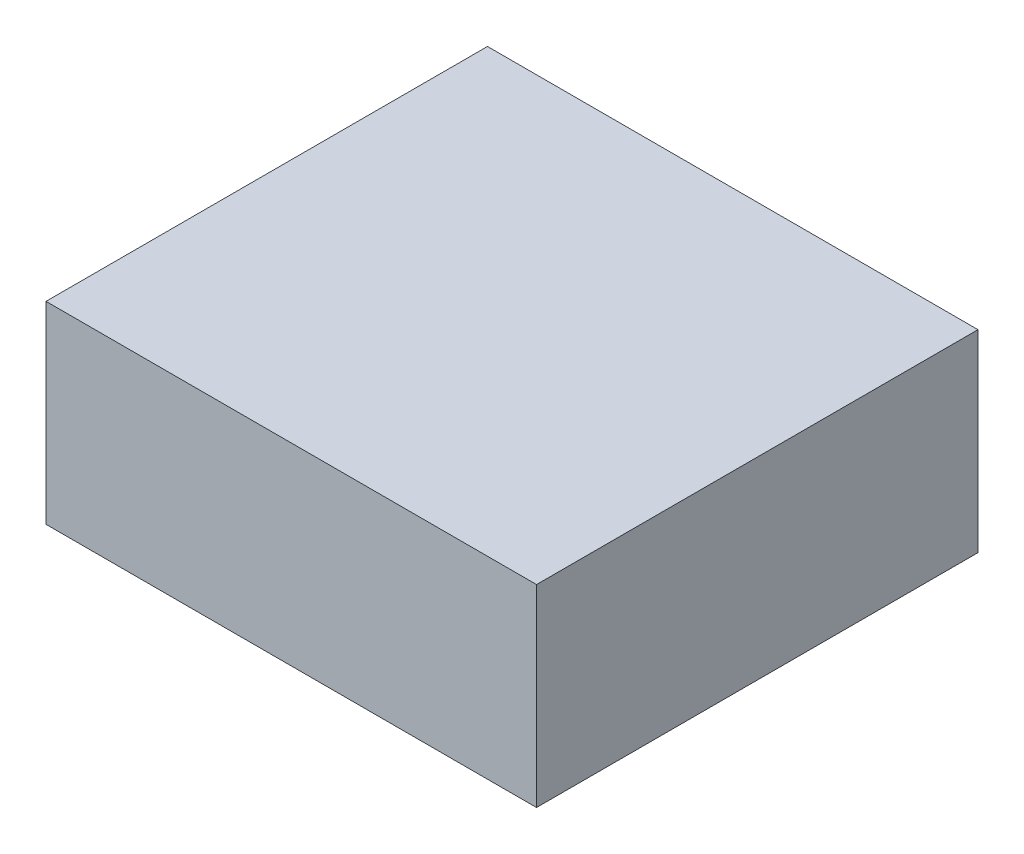
ISO-10303-21;
HEADER;
FILE_DESCRIPTION(('STEP AP214'),'2;1');
FILE_NAME('part.step','',(''),(''),'','','');
FILE_SCHEMA(('AUTOMOTIVE_DESIGN { 1 0 10303 214 1 1 1 1 }'));
ENDSEC;
DATA;
#1=APPLICATION_CONTEXT('core data for automotive mechanical design processes');
#2=APPLICATION_PROTOCOL_DEFINITION('international standard','automotive_design',2000,#1);
#3=PRODUCT_CONTEXT('',#1,'mechanical');
#4=PRODUCT('Part','Part','',(#3));
#5=PRODUCT_RELATED_PRODUCT_CATEGORY('part','',(#4));
#6=PRODUCT_DEFINITION_FORMATION('','',#4);
#7=PRODUCT_DEFINITION_CONTEXT('part definition',#1,'design');
#8=PRODUCT_DEFINITION('design','',#6,#7);
#9=PRODUCT_DEFINITION_SHAPE('','',#8);
#10=(LENGTH_UNIT() NAMED_UNIT(*) SI_UNIT(.MILLI.,.METRE.));
#11=(NAMED_UNIT(*) PLANE_ANGLE_UNIT() SI_UNIT($,.RADIAN.));
#12=(NAMED_UNIT(*) SI_UNIT($,.STERADIAN.) SOLID_ANGLE_UNIT());
#13=UNCERTAINTY_MEASURE_WITH_UNIT(LENGTH_MEASURE(1.E-05),#10,'distance_accuracy_value','');
#14=(GEOMETRIC_REPRESENTATION_CONTEXT(3) GLOBAL_UNCERTAINTY_ASSIGNED_CONTEXT((#13)) GLOBAL_UNIT_ASSIGNED_CONTEXT((#10,
#11,#12)) REPRESENTATION_CONTEXT('',''));
#15=CARTESIAN_POINT('',(0.,0.,0.));
#16=DIRECTION('',(0.,0.,1.));
#17=DIRECTION('',(1.,0.,0.));
#18=AXIS2_PLACEMENT_3D('',#15,#16,#17);
#19=CARTESIAN_POINT('',(12.7,10.,11.43));
#20=DIRECTION('',(-1.,0.,0.));
#21=DIRECTION('',(0.,0.,1.));
#22=AXIS2_PLACEMENT_3D('',#19,#20,#21);
#23=PLANE('',#22);
#24=DIRECTION('',(0.,0.,-1.));
#25=VECTOR('',#24,1.);
#26=CARTESIAN_POINT('',(12.7,0.,11.43));
#27=LINE('',#26,#25);
#28=CARTESIAN_POINT('',(12.7,0.,11.43));
#29=VERTEX_POINT('',#28);
#30=CARTESIAN_POINT('',(12.7,0.,-11.43));
#31=VERTEX_POINT('',#30);
#32=EDGE_CURVE('E96',#29,#31,#27,.T.);
#33=ORIENTED_EDGE('',*,*,#32,.T.);
#34=DIRECTION('',(0.,-1.,0.));
#35=VECTOR('',#34,1.);
#36=CARTESIAN_POINT('',(12.7,10.,-11.43));
#37=LINE('',#36,#35);
#38=CARTESIAN_POINT('',(12.7,10.,-11.43));
#39=VERTEX_POINT('',#38);
#40=EDGE_CURVE('E11',#39,#31,#37,.T.);
#41=ORIENTED_EDGE('',*,*,#40,.F.);
#42=DIRECTION('',(0.,0.,-1.));
#43=VECTOR('',#42,1.);
#44=CARTESIAN_POINT('',(12.7,10.,11.43));
#45=LINE('',#44,#43);
#46=CARTESIAN_POINT('',(12.7,10.,11.43));
#47=VERTEX_POINT('',#46);
#48=EDGE_CURVE('E84',#47,#39,#45,.T.);
#49=ORIENTED_EDGE('',*,*,#48,.F.);
#50=DIRECTION('',(0.,-1.,0.));
#51=VECTOR('',#50,1.);
#52=CARTESIAN_POINT('',(12.7,10.,11.43));
#53=LINE('',#52,#51);
#54=EDGE_CURVE('E92',#47,#29,#53,.T.);
#55=ORIENTED_EDGE('',*,*,#54,.T.);
#56=EDGE_LOOP('',(#33,#41,#49,#55));
#57=FACE_BOUND('',#56,.T.);
#58=ADVANCED_FACE('F33',(#57),#23,.F.);
#59=CARTESIAN_POINT('',(-12.7,10.,-11.43));
#60=DIRECTION('',(0.,0.,1.));
#61=DIRECTION('',(1.,0.,0.));
#62=AXIS2_PLACEMENT_3D('',#59,#60,#61);
#63=PLANE('',#62);
#64=DIRECTION('',(-1.,0.,0.));
#65=VECTOR('',#64,1.);
#66=CARTESIAN_POINT('',(-12.7,0.,-11.43));
#67=LINE('',#66,#65);
#68=CARTESIAN_POINT('',(-12.7,0.,-11.43));
#69=VERTEX_POINT('',#68);
#70=EDGE_CURVE('E88',#31,#69,#67,.T.);
#71=ORIENTED_EDGE('',*,*,#70,.T.);
#72=DIRECTION('',(0.,-1.,0.));
#73=VECTOR('',#72,1.);
#74=CARTESIAN_POINT('',(-12.7,10.,-11.43));
#75=LINE('',#74,#73);
#76=CARTESIAN_POINT('',(-12.7,10.,-11.43));
#77=VERTEX_POINT('',#76);
#78=EDGE_CURVE('E41',#77,#69,#75,.T.);
#79=ORIENTED_EDGE('',*,*,#78,.F.);
#80=DIRECTION('',(-1.,0.,0.));
#81=VECTOR('',#80,1.);
#82=CARTESIAN_POINT('',(-12.7,10.,-11.43));
#83=LINE('',#82,#81);
#84=EDGE_CURVE('E79',#39,#77,#83,.T.);
#85=ORIENTED_EDGE('',*,*,#84,.F.);
#86=ORIENTED_EDGE('',*,*,#40,.T.);
#87=EDGE_LOOP('',(#71,#79,#85,#86));
#88=FACE_BOUND('',#87,.T.);
#89=ADVANCED_FACE('F87',(#88),#63,.F.);
#90=CARTESIAN_POINT('',(-12.7,10.,11.43));
#91=DIRECTION('',(1.,0.,0.));
#92=DIRECTION('',(0.,0.,-1.));
#93=AXIS2_PLACEMENT_3D('',#90,#91,#92);
#94=PLANE('',#93);
#95=DIRECTION('',(0.,0.,1.));
#96=VECTOR('',#95,1.);
#97=CARTESIAN_POINT('',(-12.7,0.,11.43));
#98=LINE('',#97,#96);
#99=CARTESIAN_POINT('',(-12.7,0.,11.43));
#100=VERTEX_POINT('',#99);
#101=EDGE_CURVE('E66',#69,#100,#98,.T.);
#102=ORIENTED_EDGE('',*,*,#101,.T.);
#103=DIRECTION('',(0.,-1.,0.));
#104=VECTOR('',#103,1.);
#105=CARTESIAN_POINT('',(-12.7,10.,11.43));
#106=LINE('',#105,#104);
#107=CARTESIAN_POINT('',(-12.7,10.,11.43));
#108=VERTEX_POINT('',#107);
#109=EDGE_CURVE('E89',#108,#100,#106,.T.);
#110=ORIENTED_EDGE('',*,*,#109,.F.);
#111=DIRECTION('',(0.,0.,1.));
#112=VECTOR('',#111,1.);
#113=CARTESIAN_POINT('',(-12.7,10.,11.43));
#114=LINE('',#113,#112);
#115=EDGE_CURVE('E82',#77,#108,#114,.T.);
#116=ORIENTED_EDGE('',*,*,#115,.F.);
#117=ORIENTED_EDGE('',*,*,#78,.T.);
#118=EDGE_LOOP('',(#102,#110,#116,#117));
#119=FACE_BOUND('',#118,.T.);
#120=ADVANCED_FACE('F90',(#119),#94,.F.);
#121=CARTESIAN_POINT('',(-12.7,10.,11.43));
#122=DIRECTION('',(0.,0.,-1.));
#123=DIRECTION('',(-1.,0.,0.));
#124=AXIS2_PLACEMENT_3D('',#121,#122,#123);
#125=PLANE('',#124);
#126=DIRECTION('',(1.,0.,0.));
#127=VECTOR('',#126,1.);
#128=CARTESIAN_POINT('',(-12.7,0.,11.43));
#129=LINE('',#128,#127);
#130=EDGE_CURVE('E72',#100,#29,#129,.T.);
#131=ORIENTED_EDGE('',*,*,#130,.T.);
#132=ORIENTED_EDGE('',*,*,#54,.F.);
#133=DIRECTION('',(1.,0.,0.));
#134=VECTOR('',#133,1.);
#135=CARTESIAN_POINT('',(-12.7,10.,11.43));
#136=LINE('',#135,#134);
#137=EDGE_CURVE('E49',#108,#47,#136,.T.);
#138=ORIENTED_EDGE('',*,*,#137,.F.);
#139=ORIENTED_EDGE('',*,*,#109,.T.);
#140=EDGE_LOOP('',(#131,#132,#138,#139));
#141=FACE_BOUND('',#140,.T.);
#142=ADVANCED_FACE('F103',(#141),#125,.F.);
#143=CARTESIAN_POINT('',(0.,10.,0.));
#144=DIRECTION('',(0.,-1.,0.));
#145=DIRECTION('',(0.,0.,-1.));
#146=AXIS2_PLACEMENT_3D('',#143,#144,#145);
#147=PLANE('',#146);
#148=ORIENTED_EDGE('',*,*,#48,.T.);
#149=ORIENTED_EDGE('',*,*,#84,.T.);
#150=ORIENTED_EDGE('',*,*,#115,.T.);
#151=ORIENTED_EDGE('',*,*,#137,.T.);
#152=EDGE_LOOP('',(#148,#149,#150,#151));
#153=FACE_BOUND('',#152,.T.);
#154=ADVANCED_FACE('F80',(#153),#147,.F.);
#155=CARTESIAN_POINT('',(0.,0.,0.));
#156=DIRECTION('',(0.,-1.,0.));
#157=DIRECTION('',(0.,0.,-1.));
#158=AXIS2_PLACEMENT_3D('',#155,#156,#157);
#159=PLANE('',#158);
#160=ORIENTED_EDGE('',*,*,#32,.F.);
#161=ORIENTED_EDGE('',*,*,#130,.F.);
#162=ORIENTED_EDGE('',*,*,#101,.F.);
#163=ORIENTED_EDGE('',*,*,#70,.F.);
#164=EDGE_LOOP('',(#160,#161,#162,#163));
#165=FACE_BOUND('',#164,.T.);
#166=ADVANCED_FACE('F106',(#165),#159,.T.);
#167=CLOSED_SHELL('',(#58,#89,#120,#142,#154,#166));
#168=MANIFOLD_SOLID_BREP('B2',#167);
#169=ADVANCED_BREP_SHAPE_REPRESENTATION('',(#18,#168),#14);
#170=SHAPE_DEFINITION_REPRESENTATION(#9,#169);
ENDSEC;
END-ISO-10303-21;
